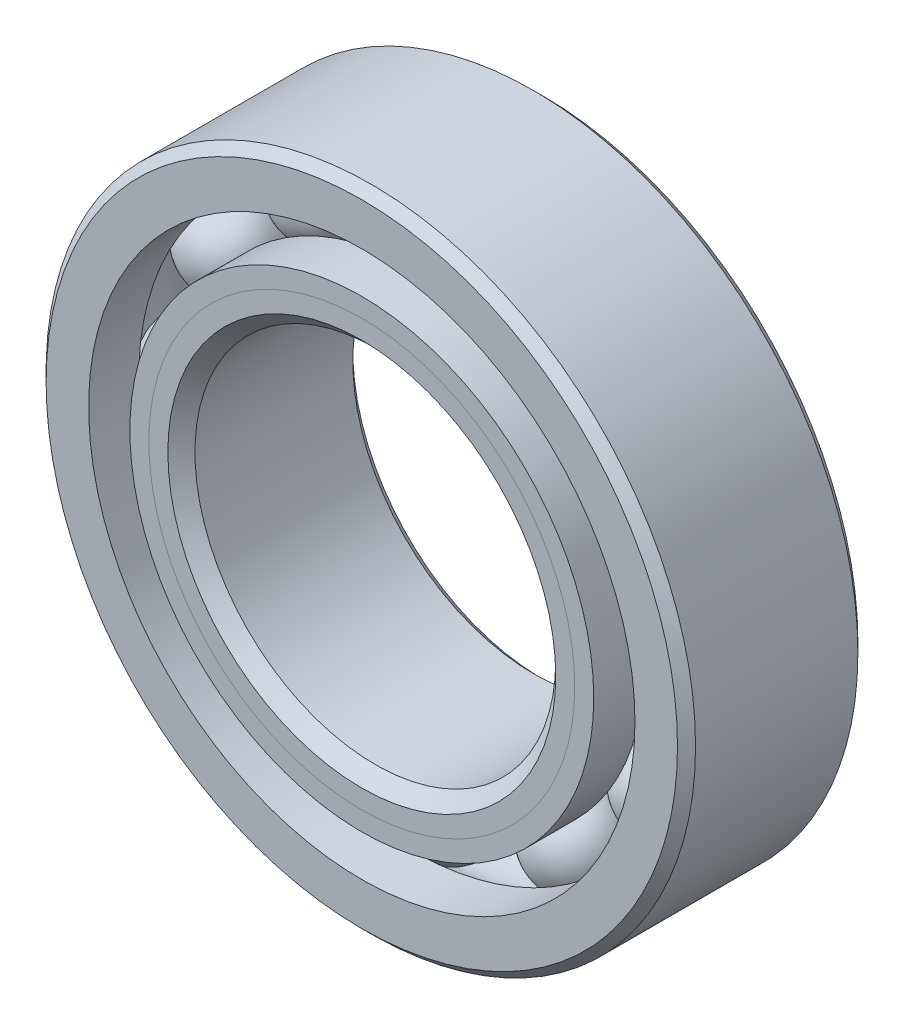
ISO-10303-21;
HEADER;
FILE_DESCRIPTION(('STEP AP214'),'2;1');
FILE_NAME('part.step','',(''),(''),'','','');
FILE_SCHEMA(('AUTOMOTIVE_DESIGN { 1 0 10303 214 1 1 1 1 }'));
ENDSEC;
DATA;
#1=APPLICATION_CONTEXT('core data for automotive mechanical design processes');
#2=APPLICATION_PROTOCOL_DEFINITION('international standard','automotive_design',2000,#1);
#3=PRODUCT_CONTEXT('',#1,'mechanical');
#4=PRODUCT('Part','Part','',(#3));
#5=PRODUCT_RELATED_PRODUCT_CATEGORY('part','',(#4));
#6=PRODUCT_DEFINITION_FORMATION('','',#4);
#7=PRODUCT_DEFINITION_CONTEXT('part definition',#1,'design');
#8=PRODUCT_DEFINITION('design','',#6,#7);
#9=PRODUCT_DEFINITION_SHAPE('','',#8);
#10=(LENGTH_UNIT() NAMED_UNIT(*) SI_UNIT(.MILLI.,.METRE.));
#11=(NAMED_UNIT(*) PLANE_ANGLE_UNIT() SI_UNIT($,.RADIAN.));
#12=(NAMED_UNIT(*) SI_UNIT($,.STERADIAN.) SOLID_ANGLE_UNIT());
#13=UNCERTAINTY_MEASURE_WITH_UNIT(LENGTH_MEASURE(1.E-05),#10,'distance_accuracy_value','');
#14=(GEOMETRIC_REPRESENTATION_CONTEXT(3) GLOBAL_UNCERTAINTY_ASSIGNED_CONTEXT((#13)) GLOBAL_UNIT_ASSIGNED_CONTEXT((#10,
#11,#12)) REPRESENTATION_CONTEXT('',''));
#15=CARTESIAN_POINT('',(0.,0.,0.));
#16=DIRECTION('',(0.,0.,1.));
#17=DIRECTION('',(1.,0.,0.));
#18=AXIS2_PLACEMENT_3D('',#15,#16,#17);
#19=CARTESIAN_POINT('',(-5.55624999999988,9.62370729955465,0.));
#20=DIRECTION('',(0.,0.,1.));
#21=DIRECTION('',(-0.499999999999989,0.866025403784445,0.));
#22=AXIS2_PLACEMENT_3D('',#19,#20,#21);
#23=SPHERICAL_SURFACE('',#22,1.9834848564108);
#24=CARTESIAN_POINT('',(-5.55624999999988,9.62370729955465,1.9834848564108));
#25=VERTEX_POINT('',#24);
#26=VERTEX_LOOP('',#25);
#27=FACE_BOUND('',#26,.T.);
#28=ADVANCED_FACE('F37',(#27),#23,.T.);
#29=CLOSED_SHELL('',(#28));
#30=MANIFOLD_SOLID_BREP('B2',#29);
#31=CARTESIAN_POINT('',(-9.62370729955451,5.55625000000011,0.));
#32=DIRECTION('',(0.,0.,1.));
#33=DIRECTION('',(-0.866025403784433,0.50000000000001,0.));
#34=AXIS2_PLACEMENT_3D('',#31,#32,#33);
#35=SPHERICAL_SURFACE('',#34,1.9834848564108);
#36=CARTESIAN_POINT('',(-9.62370729955451,5.55625000000011,1.9834848564108));
#37=VERTEX_POINT('',#36);
#38=VERTEX_LOOP('',#37);
#39=FACE_BOUND('',#38,.T.);
#40=ADVANCED_FACE('F68',(#39),#35,.T.);
#41=CLOSED_SHELL('',(#40));
#42=MANIFOLD_SOLID_BREP('B6',#41);
#43=CARTESIAN_POINT('',(-11.1125,1.16397259133683E-13,0.));
#44=DIRECTION('',(0.,0.,1.));
#45=DIRECTION('',(-1.,0.,0.));
#46=AXIS2_PLACEMENT_3D('',#43,#44,#45);
#47=SPHERICAL_SURFACE('',#46,1.9834848564108);
#48=CARTESIAN_POINT('',(-11.1125,1.16397259133683E-13,1.9834848564108));
#49=VERTEX_POINT('',#48);
#50=VERTEX_LOOP('',#49);
#51=FACE_BOUND('',#50,.T.);
#52=ADVANCED_FACE('F99',(#51),#47,.T.);
#53=CLOSED_SHELL('',(#52));
#54=MANIFOLD_SOLID_BREP('B33',#53);
#55=CARTESIAN_POINT('',(-9.62370729955463,-5.55624999999991,0.));
#56=DIRECTION('',(0.,0.,1.));
#57=DIRECTION('',(-0.866025403784443,-0.499999999999992,0.));
#58=AXIS2_PLACEMENT_3D('',#55,#56,#57);
#59=SPHERICAL_SURFACE('',#58,1.9834848564108);
#60=CARTESIAN_POINT('',(-9.62370729955463,-5.55624999999991,1.9834848564108));
#61=VERTEX_POINT('',#60);
#62=VERTEX_LOOP('',#61);
#63=FACE_BOUND('',#62,.T.);
#64=ADVANCED_FACE('F130',(#63),#59,.T.);
#65=CLOSED_SHELL('',(#64));
#66=MANIFOLD_SOLID_BREP('B64',#65);
#67=CARTESIAN_POINT('',(-5.55625000000008,-9.62370729955453,0.));
#68=DIRECTION('',(0.,0.,1.));
#69=DIRECTION('',(-0.500000000000007,-0.866025403784435,0.));
#70=AXIS2_PLACEMENT_3D('',#67,#68,#69);
#71=SPHERICAL_SURFACE('',#70,1.9834848564108);
#72=CARTESIAN_POINT('',(-5.55625000000008,-9.62370729955453,1.9834848564108));
#73=VERTEX_POINT('',#72);
#74=VERTEX_LOOP('',#73);
#75=FACE_BOUND('',#74,.T.);
#76=ADVANCED_FACE('F161',(#75),#71,.T.);
#77=CLOSED_SHELL('',(#76));
#78=MANIFOLD_SOLID_BREP('B95',#77);
#79=CARTESIAN_POINT('',(0.,-11.1125,0.));
#80=DIRECTION('',(0.,0.,1.));
#81=DIRECTION('',(0.,-1.,0.));
#82=AXIS2_PLACEMENT_3D('',#79,#80,#81);
#83=SPHERICAL_SURFACE('',#82,1.9834848564108);
#84=CARTESIAN_POINT('',(0.,-11.1125,1.9834848564108));
#85=VERTEX_POINT('',#84);
#86=VERTEX_LOOP('',#85);
#87=FACE_BOUND('',#86,.T.);
#88=ADVANCED_FACE('F192',(#87),#83,.T.);
#89=CLOSED_SHELL('',(#88));
#90=MANIFOLD_SOLID_BREP('B126',#89);
#91=CARTESIAN_POINT('',(5.55624999999994,-9.62370729955461,0.));
#92=DIRECTION('',(0.,0.,1.));
#93=DIRECTION('',(0.499999999999995,-0.866025403784442,0.));
#94=AXIS2_PLACEMENT_3D('',#91,#92,#93);
#95=SPHERICAL_SURFACE('',#94,1.9834848564108);
#96=CARTESIAN_POINT('',(5.55624999999994,-9.62370729955461,1.9834848564108));
#97=VERTEX_POINT('',#96);
#98=VERTEX_LOOP('',#97);
#99=FACE_BOUND('',#98,.T.);
#100=ADVANCED_FACE('F223',(#99),#95,.T.);
#101=CLOSED_SHELL('',(#100));
#102=MANIFOLD_SOLID_BREP('B157',#101);
#103=CARTESIAN_POINT('',(9.62370729955455,-5.55625000000005,0.));
#104=DIRECTION('',(0.,0.,1.));
#105=DIRECTION('',(0.866025403784436,-0.500000000000004,0.));
#106=AXIS2_PLACEMENT_3D('',#103,#104,#105);
#107=SPHERICAL_SURFACE('',#106,1.9834848564108);
#108=CARTESIAN_POINT('',(9.62370729955455,-5.55625000000005,1.9834848564108));
#109=VERTEX_POINT('',#108);
#110=VERTEX_LOOP('',#109);
#111=FACE_BOUND('',#110,.T.);
#112=ADVANCED_FACE('F254',(#111),#107,.T.);
#113=CLOSED_SHELL('',(#112));
#114=MANIFOLD_SOLID_BREP('B188',#113);
#115=CARTESIAN_POINT('',(11.1125,0.,0.));
#116=DIRECTION('',(0.,0.,1.));
#117=DIRECTION('',(1.,0.,0.));
#118=AXIS2_PLACEMENT_3D('',#115,#116,#117);
#119=SPHERICAL_SURFACE('',#118,1.9834848564108);
#120=CARTESIAN_POINT('',(11.1125,0.,1.9834848564108));
#121=VERTEX_POINT('',#120);
#122=VERTEX_LOOP('',#121);
#123=FACE_BOUND('',#122,.T.);
#124=ADVANCED_FACE('F285',(#123),#119,.T.);
#125=CLOSED_SHELL('',(#124));
#126=MANIFOLD_SOLID_BREP('B219',#125);
#127=CARTESIAN_POINT('',(9.62370729955459,5.55624999999998,0.));
#128=DIRECTION('',(0.,0.,1.));
#129=DIRECTION('',(0.86602540378444,0.499999999999998,0.));
#130=AXIS2_PLACEMENT_3D('',#127,#128,#129);
#131=SPHERICAL_SURFACE('',#130,1.9834848564108);
#132=CARTESIAN_POINT('',(9.62370729955459,5.55624999999998,1.9834848564108));
#133=VERTEX_POINT('',#132);
#134=VERTEX_LOOP('',#133);
#135=FACE_BOUND('',#134,.T.);
#136=ADVANCED_FACE('F316',(#135),#131,.T.);
#137=CLOSED_SHELL('',(#136));
#138=MANIFOLD_SOLID_BREP('B250',#137);
#139=CARTESIAN_POINT('',(5.55625000000001,9.62370729955457,0.));
#140=DIRECTION('',(0.,0.,1.));
#141=DIRECTION('',(0.500000000000001,0.866025403784438,0.));
#142=AXIS2_PLACEMENT_3D('',#139,#140,#141);
#143=SPHERICAL_SURFACE('',#142,1.9834848564108);
#144=CARTESIAN_POINT('',(5.55625000000001,9.62370729955457,1.9834848564108));
#145=VERTEX_POINT('',#144);
#146=VERTEX_LOOP('',#145);
#147=FACE_BOUND('',#146,.T.);
#148=ADVANCED_FACE('F347',(#147),#143,.T.);
#149=CLOSED_SHELL('',(#148));
#150=MANIFOLD_SOLID_BREP('B281',#149);
#151=CARTESIAN_POINT('',(0.,11.1125,0.));
#152=DIRECTION('',(0.,0.,1.));
#153=DIRECTION('',(0.,1.,0.));
#154=AXIS2_PLACEMENT_3D('',#151,#152,#153);
#155=SPHERICAL_SURFACE('',#154,1.9834848564108);
#156=CARTESIAN_POINT('',(0.,11.1125,1.9834848564108));
#157=VERTEX_POINT('',#156);
#158=VERTEX_LOOP('',#157);
#159=FACE_BOUND('',#158,.T.);
#160=ADVANCED_FACE('F380',(#159),#155,.T.);
#161=CLOSED_SHELL('',(#160));
#162=MANIFOLD_SOLID_BREP('B312',#161);
#163=CARTESIAN_POINT('',(0.,9.36930735732587,3.96875));
#164=DIRECTION('',(0.,0.,-1.));
#165=DIRECTION('',(-1.,0.,0.));
#166=AXIS2_PLACEMENT_3D('',#163,#164,#165);
#167=PLANE('',#166);
#168=CARTESIAN_POINT('',(0.,0.,3.96875));
#169=DIRECTION('',(0.,0.,1.));
#170=DIRECTION('',(1.,0.,0.));
#171=AXIS2_PLACEMENT_3D('',#168,#169,#170);
#172=CIRCLE('',#171,8.5332575717946);
#173=CARTESIAN_POINT('',(8.5332575717946,0.,3.96875));
#174=VERTEX_POINT('',#173);
#175=EDGE_CURVE('E434',#174,#174,#172,.T.);
#176=ORIENTED_EDGE('',*,*,#175,.F.);
#177=EDGE_LOOP('',(#176));
#178=FACE_BOUND('',#177,.T.);
#179=CARTESIAN_POINT('',(0.,0.,3.96875));
#180=DIRECTION('',(0.,0.,1.));
#181=DIRECTION('',(1.,0.,0.));
#182=AXIS2_PLACEMENT_3D('',#179,#180,#181);
#183=CIRCLE('',#182,9.36930735732587);
#184=CARTESIAN_POINT('',(9.36930735732587,0.,3.96875));
#185=VERTEX_POINT('',#184);
#186=EDGE_CURVE('E379',#185,#185,#183,.T.);
#187=ORIENTED_EDGE('',*,*,#186,.T.);
#188=EDGE_LOOP('',(#187));
#189=FACE_BOUND('',#188,.T.);
#190=ADVANCED_FACE('F400',(#178,#189),#167,.F.);
#191=CARTESIAN_POINT('',(0.,0.,3.13270021446873));
#192=DIRECTION('',(0.,0.,1.));
#193=DIRECTION('',(1.,0.,0.));
#194=AXIS2_PLACEMENT_3D('',#191,#192,#193);
#195=CONICAL_SURFACE('',#194,8.5332575717946,0.78539816339745);
#196=ORIENTED_EDGE('',*,*,#186,.F.);
#197=EDGE_LOOP('',(#196));
#198=FACE_BOUND('',#197,.T.);
#199=CARTESIAN_POINT('',(0.,0.,3.13270021446873));
#200=DIRECTION('',(0.,0.,1.));
#201=DIRECTION('',(1.,0.,0.));
#202=AXIS2_PLACEMENT_3D('',#199,#200,#201);
#203=CIRCLE('',#202,8.5332575717946);
#204=CARTESIAN_POINT('',(8.5332575717946,0.,3.13270021446873));
#205=VERTEX_POINT('',#204);
#206=EDGE_CURVE('E406',#205,#205,#203,.T.);
#207=ORIENTED_EDGE('',*,*,#206,.T.);
#208=EDGE_LOOP('',(#207));
#209=FACE_BOUND('',#208,.T.);
#210=ADVANCED_FACE('F441',(#198,#209),#195,.T.);
#211=CARTESIAN_POINT('',(0.,0.,3.96875));
#212=DIRECTION('',(0.,0.,1.));
#213=DIRECTION('',(1.,0.,0.));
#214=AXIS2_PLACEMENT_3D('',#211,#212,#213);
#215=CYLINDRICAL_SURFACE('',#214,8.5332575717946);
#216=ORIENTED_EDGE('',*,*,#206,.F.);
#217=EDGE_LOOP('',(#216));
#218=FACE_BOUND('',#217,.T.);
#219=CARTESIAN_POINT('',(0.,0.,0.));
#220=DIRECTION('',(0.,0.,1.));
#221=DIRECTION('',(1.,0.,0.));
#222=AXIS2_PLACEMENT_3D('',#219,#220,#221);
#223=CIRCLE('',#222,8.5332575717946);
#224=CARTESIAN_POINT('',(8.5332575717946,0.,0.));
#225=VERTEX_POINT('',#224);
#226=EDGE_CURVE('E410',#225,#225,#223,.T.);
#227=ORIENTED_EDGE('',*,*,#226,.T.);
#228=EDGE_LOOP('',(#227));
#229=FACE_BOUND('',#228,.T.);
#230=ADVANCED_FACE('F445',(#218,#229),#215,.T.);
#231=CARTESIAN_POINT('',(0.,8.5332575717946,0.));
#232=DIRECTION('',(0.,0.,-1.));
#233=DIRECTION('',(-1.,0.,0.));
#234=AXIS2_PLACEMENT_3D('',#231,#232,#233);
#235=PLANE('',#234);
#236=ORIENTED_EDGE('',*,*,#226,.F.);
#237=EDGE_LOOP('',(#236));
#238=FACE_BOUND('',#237,.T.);
#239=CARTESIAN_POINT('',(0.,0.,0.));
#240=DIRECTION('',(0.,0.,1.));
#241=DIRECTION('',(1.,0.,0.));
#242=AXIS2_PLACEMENT_3D('',#239,#240,#241);
#243=CIRCLE('',#242,9.1290151435892);
#244=CARTESIAN_POINT('',(9.1290151435892,0.,0.));
#245=VERTEX_POINT('',#244);
#246=EDGE_CURVE('E414',#245,#245,#243,.T.);
#247=ORIENTED_EDGE('',*,*,#246,.T.);
#248=EDGE_LOOP('',(#247));
#249=FACE_BOUND('',#248,.T.);
#250=ADVANCED_FACE('F450',(#238,#249),#235,.F.);
#251=CARTESIAN_POINT('',(0.,0.,0.));
#252=DIRECTION('',(0.,0.,1.));
#253=DIRECTION('',(1.,0.,0.));
#254=AXIS2_PLACEMENT_3D('',#251,#252,#253);
#255=TOROIDAL_SURFACE('',#254,11.1125,1.9834848564108);
#256=ORIENTED_EDGE('',*,*,#246,.F.);
#257=EDGE_LOOP('',(#256));
#258=FACE_BOUND('',#257,.T.);
#259=CARTESIAN_POINT('',(0.,0.,-1.76388888888889));
#260=DIRECTION('',(0.,0.,1.));
#261=DIRECTION('',(1.,0.,0.));
#262=AXIS2_PLACEMENT_3D('',#259,#260,#261);
#263=CIRCLE('',#262,10.2053571428571);
#264=CARTESIAN_POINT('',(10.2053571428571,0.,-1.76388888888889));
#265=VERTEX_POINT('',#264);
#266=EDGE_CURVE('E419',#265,#265,#263,.T.);
#267=ORIENTED_EDGE('',*,*,#266,.T.);
#268=EDGE_LOOP('',(#267));
#269=FACE_BOUND('',#268,.T.);
#270=ADVANCED_FACE('F456',(#258,#269),#255,.F.);
#271=CARTESIAN_POINT('',(0.,0.,3.96875));
#272=DIRECTION('',(0.,0.,1.));
#273=DIRECTION('',(1.,0.,0.));
#274=AXIS2_PLACEMENT_3D('',#271,#272,#273);
#275=CYLINDRICAL_SURFACE('',#274,10.2053571428571);
#276=ORIENTED_EDGE('',*,*,#266,.F.);
#277=EDGE_LOOP('',(#276));
#278=FACE_BOUND('',#277,.T.);
#279=CARTESIAN_POINT('',(0.,0.,-3.96875));
#280=DIRECTION('',(0.,0.,1.));
#281=DIRECTION('',(1.,0.,0.));
#282=AXIS2_PLACEMENT_3D('',#279,#280,#281);
#283=CIRCLE('',#282,10.2053571428571);
#284=CARTESIAN_POINT('',(10.2053571428571,0.,-3.96875));
#285=VERTEX_POINT('',#284);
#286=EDGE_CURVE('E422',#285,#285,#283,.T.);
#287=ORIENTED_EDGE('',*,*,#286,.T.);
#288=EDGE_LOOP('',(#287));
#289=FACE_BOUND('',#288,.T.);
#290=ADVANCED_FACE('F460',(#278,#289),#275,.T.);
#291=CARTESIAN_POINT('',(0.,8.334375,-3.96875));
#292=DIRECTION('',(0.,0.,1.));
#293=DIRECTION('',(1.,0.,0.));
#294=AXIS2_PLACEMENT_3D('',#291,#292,#293);
#295=PLANE('',#294);
#296=ORIENTED_EDGE('',*,*,#286,.F.);
#297=EDGE_LOOP('',(#296));
#298=FACE_BOUND('',#297,.T.);
#299=CARTESIAN_POINT('',(0.,0.,-3.96875));
#300=DIRECTION('',(0.,0.,1.));
#301=DIRECTION('',(1.,0.,0.));
#302=AXIS2_PLACEMENT_3D('',#299,#300,#301);
#303=CIRCLE('',#302,8.334375);
#304=CARTESIAN_POINT('',(8.334375,0.,-3.96875));
#305=VERTEX_POINT('',#304);
#306=EDGE_CURVE('E425',#305,#305,#303,.T.);
#307=ORIENTED_EDGE('',*,*,#306,.T.);
#308=EDGE_LOOP('',(#307));
#309=FACE_BOUND('',#308,.T.);
#310=ADVANCED_FACE('F464',(#298,#309),#295,.F.);
#311=CARTESIAN_POINT('',(0.,0.,-3.571875));
#312=DIRECTION('',(0.,0.,-1.));
#313=DIRECTION('',(-1.,0.,0.));
#314=AXIS2_PLACEMENT_3D('',#311,#312,#313);
#315=CONICAL_SURFACE('',#314,7.9375,0.785398163397448);
#316=ORIENTED_EDGE('',*,*,#306,.F.);
#317=EDGE_LOOP('',(#316));
#318=FACE_BOUND('',#317,.T.);
#319=CARTESIAN_POINT('',(0.,0.,-3.571875));
#320=DIRECTION('',(0.,0.,1.));
#321=DIRECTION('',(1.,0.,0.));
#322=AXIS2_PLACEMENT_3D('',#319,#320,#321);
#323=CIRCLE('',#322,7.9375);
#324=CARTESIAN_POINT('',(7.9375,0.,-3.571875));
#325=VERTEX_POINT('',#324);
#326=EDGE_CURVE('E428',#325,#325,#323,.T.);
#327=ORIENTED_EDGE('',*,*,#326,.T.);
#328=EDGE_LOOP('',(#327));
#329=FACE_BOUND('',#328,.T.);
#330=ADVANCED_FACE('F468',(#318,#329),#315,.F.);
#331=CARTESIAN_POINT('',(0.,0.,3.96875));
#332=DIRECTION('',(0.,0.,1.));
#333=DIRECTION('',(1.,0.,0.));
#334=AXIS2_PLACEMENT_3D('',#331,#332,#333);
#335=CYLINDRICAL_SURFACE('',#334,7.9375);
#336=ORIENTED_EDGE('',*,*,#326,.F.);
#337=EDGE_LOOP('',(#336));
#338=FACE_BOUND('',#337,.T.);
#339=CARTESIAN_POINT('',(0.,0.,3.3729924282054));
#340=DIRECTION('',(0.,0.,1.));
#341=DIRECTION('',(1.,0.,0.));
#342=AXIS2_PLACEMENT_3D('',#339,#340,#341);
#343=CIRCLE('',#342,7.9375);
#344=CARTESIAN_POINT('',(7.9375,0.,3.3729924282054));
#345=VERTEX_POINT('',#344);
#346=EDGE_CURVE('E431',#345,#345,#343,.T.);
#347=ORIENTED_EDGE('',*,*,#346,.T.);
#348=EDGE_LOOP('',(#347));
#349=FACE_BOUND('',#348,.T.);
#350=ADVANCED_FACE('F472',(#338,#349),#335,.F.);
#351=CARTESIAN_POINT('',(0.,0.,3.96875));
#352=DIRECTION('',(0.,0.,1.));
#353=DIRECTION('',(1.,0.,0.));
#354=AXIS2_PLACEMENT_3D('',#351,#352,#353);
#355=CONICAL_SURFACE('',#354,8.5332575717946,0.78539816339745);
#356=ORIENTED_EDGE('',*,*,#346,.F.);
#357=EDGE_LOOP('',(#356));
#358=FACE_BOUND('',#357,.T.);
#359=ORIENTED_EDGE('',*,*,#175,.T.);
#360=EDGE_LOOP('',(#359));
#361=FACE_BOUND('',#360,.T.);
#362=ADVANCED_FACE('F438',(#358,#361),#355,.F.);
#363=CLOSED_SHELL('',(#190,#210,#230,#250,#270,#290,#310,#330,#350,#362));
#364=MANIFOLD_SOLID_BREP('B343',#363);
#365=CARTESIAN_POINT('',(0.,10.2053571428571,3.96875));
#366=DIRECTION('',(0.,0.,-1.));
#367=DIRECTION('',(-1.,0.,0.));
#368=AXIS2_PLACEMENT_3D('',#365,#366,#367);
#369=PLANE('',#368);
#370=CARTESIAN_POINT('',(0.,0.,3.96875));
#371=DIRECTION('',(0.,0.,1.));
#372=DIRECTION('',(1.,0.,0.));
#373=AXIS2_PLACEMENT_3D('',#370,#371,#372);
#374=CIRCLE('',#373,9.36930735732587);
#375=CARTESIAN_POINT('',(9.36930735732587,0.,3.96875));
#376=VERTEX_POINT('',#375);
#377=EDGE_CURVE('E399',#376,#376,#374,.T.);
#378=ORIENTED_EDGE('',*,*,#377,.F.);
#379=EDGE_LOOP('',(#378));
#380=FACE_BOUND('',#379,.T.);
#381=CARTESIAN_POINT('',(0.,0.,3.96875));
#382=DIRECTION('',(0.,0.,1.));
#383=DIRECTION('',(1.,0.,0.));
#384=AXIS2_PLACEMENT_3D('',#381,#382,#383);
#385=CIRCLE('',#384,10.2053571428571);
#386=CARTESIAN_POINT('',(10.2053571428571,0.,3.96875));
#387=VERTEX_POINT('',#386);
#388=EDGE_CURVE('E580',#387,#387,#385,.T.);
#389=ORIENTED_EDGE('',*,*,#388,.T.);
#390=EDGE_LOOP('',(#389));
#391=FACE_BOUND('',#390,.T.);
#392=ADVANCED_FACE('F558',(#380,#391),#369,.F.);
#393=CARTESIAN_POINT('',(0.,0.,3.96875));
#394=DIRECTION('',(0.,0.,1.));
#395=DIRECTION('',(1.,0.,0.));
#396=AXIS2_PLACEMENT_3D('',#393,#394,#395);
#397=CONICAL_SURFACE('',#396,9.36930735732587,0.78539816339745);
#398=CARTESIAN_POINT('',(0.,0.,3.13270021446873));
#399=DIRECTION('',(0.,0.,1.));
#400=DIRECTION('',(1.,0.,0.));
#401=AXIS2_PLACEMENT_3D('',#398,#399,#400);
#402=CIRCLE('',#401,8.5332575717946);
#403=CARTESIAN_POINT('',(8.5332575717946,0.,3.13270021446873));
#404=VERTEX_POINT('',#403);
#405=EDGE_CURVE('E564',#404,#404,#402,.T.);
#406=ORIENTED_EDGE('',*,*,#405,.F.);
#407=EDGE_LOOP('',(#406));
#408=FACE_BOUND('',#407,.T.);
#409=ORIENTED_EDGE('',*,*,#377,.T.);
#410=EDGE_LOOP('',(#409));
#411=FACE_BOUND('',#410,.T.);
#412=ADVANCED_FACE('F605',(#408,#411),#397,.F.);
#413=CARTESIAN_POINT('',(0.,0.,3.96875));
#414=DIRECTION('',(0.,0.,1.));
#415=DIRECTION('',(1.,0.,0.));
#416=AXIS2_PLACEMENT_3D('',#413,#414,#415);
#417=CYLINDRICAL_SURFACE('',#416,8.5332575717946);
#418=CARTESIAN_POINT('',(0.,0.,0.));
#419=DIRECTION('',(0.,0.,1.));
#420=DIRECTION('',(1.,0.,0.));
#421=AXIS2_PLACEMENT_3D('',#418,#419,#420);
#422=CIRCLE('',#421,8.5332575717946);
#423=CARTESIAN_POINT('',(8.5332575717946,0.,0.));
#424=VERTEX_POINT('',#423);
#425=EDGE_CURVE('E568',#424,#424,#422,.T.);
#426=ORIENTED_EDGE('',*,*,#425,.F.);
#427=EDGE_LOOP('',(#426));
#428=FACE_BOUND('',#427,.T.);
#429=ORIENTED_EDGE('',*,*,#405,.T.);
#430=EDGE_LOOP('',(#429));
#431=FACE_BOUND('',#430,.T.);
#432=ADVANCED_FACE('F600',(#428,#431),#417,.F.);
#433=CARTESIAN_POINT('',(0.,8.5332575717946,0.));
#434=DIRECTION('',(0.,0.,1.));
#435=DIRECTION('',(1.,0.,0.));
#436=AXIS2_PLACEMENT_3D('',#433,#434,#435);
#437=PLANE('',#436);
#438=CARTESIAN_POINT('',(0.,0.,0.));
#439=DIRECTION('',(0.,0.,1.));
#440=DIRECTION('',(1.,0.,0.));
#441=AXIS2_PLACEMENT_3D('',#438,#439,#440);
#442=CIRCLE('',#441,9.1290151435892);
#443=CARTESIAN_POINT('',(9.1290151435892,0.,0.));
#444=VERTEX_POINT('',#443);
#445=EDGE_CURVE('E572',#444,#444,#442,.T.);
#446=ORIENTED_EDGE('',*,*,#445,.F.);
#447=EDGE_LOOP('',(#446));
#448=FACE_BOUND('',#447,.T.);
#449=ORIENTED_EDGE('',*,*,#425,.T.);
#450=EDGE_LOOP('',(#449));
#451=FACE_BOUND('',#450,.T.);
#452=ADVANCED_FACE('F594',(#448,#451),#437,.F.);
#453=CARTESIAN_POINT('',(0.,0.,0.));
#454=DIRECTION('',(0.,0.,1.));
#455=DIRECTION('',(1.,0.,0.));
#456=AXIS2_PLACEMENT_3D('',#453,#454,#455);
#457=TOROIDAL_SURFACE('',#456,11.1125,1.9834848564108);
#458=CARTESIAN_POINT('',(0.,0.,1.76388888888889));
#459=DIRECTION('',(0.,0.,1.));
#460=DIRECTION('',(1.,0.,0.));
#461=AXIS2_PLACEMENT_3D('',#458,#459,#460);
#462=CIRCLE('',#461,10.2053571428571);
#463=CARTESIAN_POINT('',(10.2053571428571,0.,1.76388888888889));
#464=VERTEX_POINT('',#463);
#465=EDGE_CURVE('E577',#464,#464,#462,.T.);
#466=ORIENTED_EDGE('',*,*,#465,.F.);
#467=EDGE_LOOP('',(#466));
#468=FACE_BOUND('',#467,.T.);
#469=ORIENTED_EDGE('',*,*,#445,.T.);
#470=EDGE_LOOP('',(#469));
#471=FACE_BOUND('',#470,.T.);
#472=ADVANCED_FACE('F588',(#468,#471),#457,.F.);
#473=CARTESIAN_POINT('',(0.,0.,3.96875));
#474=DIRECTION('',(0.,0.,1.));
#475=DIRECTION('',(1.,0.,0.));
#476=AXIS2_PLACEMENT_3D('',#473,#474,#475);
#477=CYLINDRICAL_SURFACE('',#476,10.2053571428571);
#478=ORIENTED_EDGE('',*,*,#388,.F.);
#479=EDGE_LOOP('',(#478));
#480=FACE_BOUND('',#479,.T.);
#481=ORIENTED_EDGE('',*,*,#465,.T.);
#482=EDGE_LOOP('',(#481));
#483=FACE_BOUND('',#482,.T.);
#484=ADVANCED_FACE('F585',(#480,#483),#477,.T.);
#485=CLOSED_SHELL('',(#392,#412,#432,#452,#472,#484));
#486=MANIFOLD_SOLID_BREP('B374',#485);
#487=CARTESIAN_POINT('',(0.,0.,3.571875));
#488=DIRECTION('',(0.,0.,-1.));
#489=DIRECTION('',(-1.,0.,0.));
#490=AXIS2_PLACEMENT_3D('',#487,#488,#489);
#491=CONICAL_SURFACE('',#490,14.2875,0.785398163397449);
#492=CARTESIAN_POINT('',(0.,0.,3.96875));
#493=DIRECTION('',(0.,0.,1.));
#494=DIRECTION('',(1.,0.,0.));
#495=AXIS2_PLACEMENT_3D('',#492,#493,#494);
#496=CIRCLE('',#495,13.890625);
#497=CARTESIAN_POINT('',(13.890625,0.,3.96875));
#498=VERTEX_POINT('',#497);
#499=EDGE_CURVE('E677',#498,#498,#496,.T.);
#500=ORIENTED_EDGE('',*,*,#499,.F.);
#501=EDGE_LOOP('',(#500));
#502=FACE_BOUND('',#501,.T.);
#503=CARTESIAN_POINT('',(0.,0.,3.571875));
#504=DIRECTION('',(0.,0.,1.));
#505=DIRECTION('',(1.,0.,0.));
#506=AXIS2_PLACEMENT_3D('',#503,#504,#505);
#507=CIRCLE('',#506,14.2875);
#508=CARTESIAN_POINT('',(14.2875,0.,3.571875));
#509=VERTEX_POINT('',#508);
#510=EDGE_CURVE('E557',#509,#509,#507,.T.);
#511=ORIENTED_EDGE('',*,*,#510,.T.);
#512=EDGE_LOOP('',(#511));
#513=FACE_BOUND('',#512,.T.);
#514=ADVANCED_FACE('F649',(#502,#513),#491,.T.);
#515=CARTESIAN_POINT('',(0.,0.,3.96875));
#516=DIRECTION('',(0.,0.,1.));
#517=DIRECTION('',(1.,0.,0.));
#518=AXIS2_PLACEMENT_3D('',#515,#516,#517);
#519=CYLINDRICAL_SURFACE('',#518,14.2875);
#520=ORIENTED_EDGE('',*,*,#510,.F.);
#521=EDGE_LOOP('',(#520));
#522=FACE_BOUND('',#521,.T.);
#523=CARTESIAN_POINT('',(0.,0.,-3.571875));
#524=DIRECTION('',(0.,0.,1.));
#525=DIRECTION('',(1.,0.,0.));
#526=AXIS2_PLACEMENT_3D('',#523,#524,#525);
#527=CIRCLE('',#526,14.2875);
#528=CARTESIAN_POINT('',(14.2875,0.,-3.571875));
#529=VERTEX_POINT('',#528);
#530=EDGE_CURVE('E655',#529,#529,#527,.T.);
#531=ORIENTED_EDGE('',*,*,#530,.T.);
#532=EDGE_LOOP('',(#531));
#533=FACE_BOUND('',#532,.T.);
#534=ADVANCED_FACE('F684',(#522,#533),#519,.T.);
#535=CARTESIAN_POINT('',(0.,0.,-3.96875));
#536=DIRECTION('',(0.,0.,1.));
#537=DIRECTION('',(1.,0.,0.));
#538=AXIS2_PLACEMENT_3D('',#535,#536,#537);
#539=CONICAL_SURFACE('',#538,13.890625,0.785398163397448);
#540=ORIENTED_EDGE('',*,*,#530,.F.);
#541=EDGE_LOOP('',(#540));
#542=FACE_BOUND('',#541,.T.);
#543=CARTESIAN_POINT('',(0.,0.,-3.96875));
#544=DIRECTION('',(0.,0.,1.));
#545=DIRECTION('',(1.,0.,0.));
#546=AXIS2_PLACEMENT_3D('',#543,#544,#545);
#547=CIRCLE('',#546,13.890625);
#548=CARTESIAN_POINT('',(13.890625,0.,-3.96875));
#549=VERTEX_POINT('',#548);
#550=EDGE_CURVE('E659',#549,#549,#547,.T.);
#551=ORIENTED_EDGE('',*,*,#550,.T.);
#552=EDGE_LOOP('',(#551));
#553=FACE_BOUND('',#552,.T.);
#554=ADVANCED_FACE('F688',(#542,#553),#539,.T.);
#555=CARTESIAN_POINT('',(0.,13.890625,-3.96875));
#556=DIRECTION('',(0.,0.,1.));
#557=DIRECTION('',(1.,0.,0.));
#558=AXIS2_PLACEMENT_3D('',#555,#556,#557);
#559=PLANE('',#558);
#560=ORIENTED_EDGE('',*,*,#550,.F.);
#561=EDGE_LOOP('',(#560));
#562=FACE_BOUND('',#561,.T.);
#563=CARTESIAN_POINT('',(0.,0.,-3.96875));
#564=DIRECTION('',(0.,0.,1.));
#565=DIRECTION('',(1.,0.,0.));
#566=AXIS2_PLACEMENT_3D('',#563,#564,#565);
#567=CIRCLE('',#566,12.0196428571429);
#568=CARTESIAN_POINT('',(12.0196428571429,0.,-3.96875));
#569=VERTEX_POINT('',#568);
#570=EDGE_CURVE('E663',#569,#569,#567,.T.);
#571=ORIENTED_EDGE('',*,*,#570,.T.);
#572=EDGE_LOOP('',(#571));
#573=FACE_BOUND('',#572,.T.);
#574=ADVANCED_FACE('F693',(#562,#573),#559,.F.);
#575=CARTESIAN_POINT('',(0.,0.,3.96875));
#576=DIRECTION('',(0.,0.,1.));
#577=DIRECTION('',(1.,0.,0.));
#578=AXIS2_PLACEMENT_3D('',#575,#576,#577);
#579=CYLINDRICAL_SURFACE('',#578,12.0196428571429);
#580=ORIENTED_EDGE('',*,*,#570,.F.);
#581=EDGE_LOOP('',(#580));
#582=FACE_BOUND('',#581,.T.);
#583=CARTESIAN_POINT('',(0.,0.,-1.76388888888889));
#584=DIRECTION('',(0.,0.,1.));
#585=DIRECTION('',(1.,0.,0.));
#586=AXIS2_PLACEMENT_3D('',#583,#584,#585);
#587=CIRCLE('',#586,12.0196428571429);
#588=CARTESIAN_POINT('',(12.0196428571429,0.,-1.76388888888889));
#589=VERTEX_POINT('',#588);
#590=EDGE_CURVE('E668',#589,#589,#587,.T.);
#591=ORIENTED_EDGE('',*,*,#590,.T.);
#592=EDGE_LOOP('',(#591));
#593=FACE_BOUND('',#592,.T.);
#594=ADVANCED_FACE('F699',(#582,#593),#579,.F.);
#595=CARTESIAN_POINT('',(0.,0.,0.));
#596=DIRECTION('',(0.,0.,1.));
#597=DIRECTION('',(1.,0.,0.));
#598=AXIS2_PLACEMENT_3D('',#595,#596,#597);
#599=TOROIDAL_SURFACE('',#598,11.1125,1.9834848564108);
#600=ORIENTED_EDGE('',*,*,#590,.F.);
#601=EDGE_LOOP('',(#600));
#602=FACE_BOUND('',#601,.T.);
#603=CARTESIAN_POINT('',(0.,0.,1.76388888888889));
#604=DIRECTION('',(0.,0.,1.));
#605=DIRECTION('',(1.,0.,0.));
#606=AXIS2_PLACEMENT_3D('',#603,#604,#605);
#607=CIRCLE('',#606,12.0196428571429);
#608=CARTESIAN_POINT('',(12.0196428571429,0.,1.76388888888889));
#609=VERTEX_POINT('',#608);
#610=EDGE_CURVE('E671',#609,#609,#607,.T.);
#611=ORIENTED_EDGE('',*,*,#610,.T.);
#612=EDGE_LOOP('',(#611));
#613=FACE_BOUND('',#612,.T.);
#614=ADVANCED_FACE('F703',(#602,#613),#599,.F.);
#615=CARTESIAN_POINT('',(0.,0.,3.96875));
#616=DIRECTION('',(0.,0.,1.));
#617=DIRECTION('',(1.,0.,0.));
#618=AXIS2_PLACEMENT_3D('',#615,#616,#617);
#619=CYLINDRICAL_SURFACE('',#618,12.0196428571429);
#620=ORIENTED_EDGE('',*,*,#610,.F.);
#621=EDGE_LOOP('',(#620));
#622=FACE_BOUND('',#621,.T.);
#623=CARTESIAN_POINT('',(0.,0.,3.96875));
#624=DIRECTION('',(0.,0.,1.));
#625=DIRECTION('',(1.,0.,0.));
#626=AXIS2_PLACEMENT_3D('',#623,#624,#625);
#627=CIRCLE('',#626,12.0196428571429);
#628=CARTESIAN_POINT('',(12.0196428571429,0.,3.96875));
#629=VERTEX_POINT('',#628);
#630=EDGE_CURVE('E674',#629,#629,#627,.T.);
#631=ORIENTED_EDGE('',*,*,#630,.T.);
#632=EDGE_LOOP('',(#631));
#633=FACE_BOUND('',#632,.T.);
#634=ADVANCED_FACE('F707',(#622,#633),#619,.F.);
#635=CARTESIAN_POINT('',(0.,13.890625,3.96875));
#636=DIRECTION('',(0.,0.,-1.));
#637=DIRECTION('',(-1.,0.,0.));
#638=AXIS2_PLACEMENT_3D('',#635,#636,#637);
#639=PLANE('',#638);
#640=ORIENTED_EDGE('',*,*,#630,.F.);
#641=EDGE_LOOP('',(#640));
#642=FACE_BOUND('',#641,.T.);
#643=ORIENTED_EDGE('',*,*,#499,.T.);
#644=EDGE_LOOP('',(#643));
#645=FACE_BOUND('',#644,.T.);
#646=ADVANCED_FACE('F681',(#642,#645),#639,.F.);
#647=CLOSED_SHELL('',(#514,#534,#554,#574,#594,#614,#634,#646));
#648=MANIFOLD_SOLID_BREP('B394',#647);
#649=ADVANCED_BREP_SHAPE_REPRESENTATION('',(#18,#30,#42,#54,#66,#78,#90,#102,#114,#126,#138,
#150,#162,#364,#486,#648),#14);
#650=SHAPE_DEFINITION_REPRESENTATION(#9,#649);
ENDSEC;
END-ISO-10303-21;
